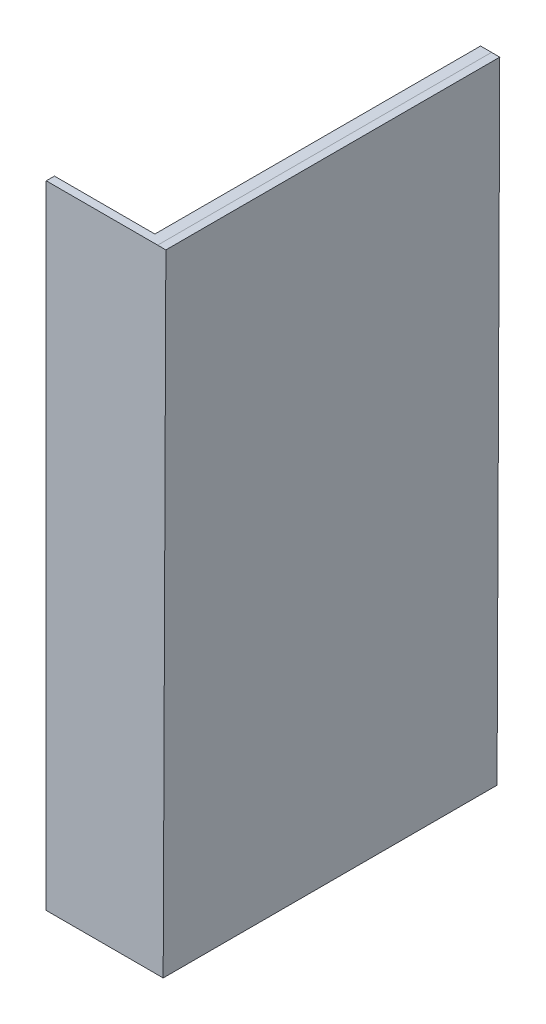
ISO-10303-21;
HEADER;
FILE_DESCRIPTION(('STEP AP214'),'2;1');
FILE_NAME('part.step','',(''),(''),'','','');
FILE_SCHEMA(('AUTOMOTIVE_DESIGN { 1 0 10303 214 1 1 1 1 }'));
ENDSEC;
DATA;
#1=APPLICATION_CONTEXT('core data for automotive mechanical design processes');
#2=APPLICATION_PROTOCOL_DEFINITION('international standard','automotive_design',2000,#1);
#3=PRODUCT_CONTEXT('',#1,'mechanical');
#4=PRODUCT('Part','Part','',(#3));
#5=PRODUCT_RELATED_PRODUCT_CATEGORY('part','',(#4));
#6=PRODUCT_DEFINITION_FORMATION('','',#4);
#7=PRODUCT_DEFINITION_CONTEXT('part definition',#1,'design');
#8=PRODUCT_DEFINITION('design','',#6,#7);
#9=PRODUCT_DEFINITION_SHAPE('','',#8);
#10=(LENGTH_UNIT() NAMED_UNIT(*) SI_UNIT(.MILLI.,.METRE.));
#11=(NAMED_UNIT(*) PLANE_ANGLE_UNIT() SI_UNIT($,.RADIAN.));
#12=(NAMED_UNIT(*) SI_UNIT($,.STERADIAN.) SOLID_ANGLE_UNIT());
#13=UNCERTAINTY_MEASURE_WITH_UNIT(LENGTH_MEASURE(1.E-05),#10,'distance_accuracy_value','');
#14=(GEOMETRIC_REPRESENTATION_CONTEXT(3) GLOBAL_UNCERTAINTY_ASSIGNED_CONTEXT((#13)) GLOBAL_UNIT_ASSIGNED_CONTEXT((#10,
#11,#12)) REPRESENTATION_CONTEXT('',''));
#15=CARTESIAN_POINT('',(0.,0.,0.));
#16=DIRECTION('',(0.,0.,1.));
#17=DIRECTION('',(1.,0.,0.));
#18=AXIS2_PLACEMENT_3D('',#15,#16,#17);
#19=CARTESIAN_POINT('',(-1606.841446163,1223.69751937865,150.));
#20=DIRECTION('',(0.,-1.,0.));
#21=DIRECTION('',(0.,0.,-1.));
#22=AXIS2_PLACEMENT_3D('',#19,#20,#21);
#23=PLANE('',#22);
#24=DIRECTION('',(0.,0.,-1.));
#25=VECTOR('',#24,1.);
#26=CARTESIAN_POINT('',(429.510216102072,1223.69751937865,150.));
#27=LINE('',#26,#25);
#28=CARTESIAN_POINT('',(429.510216102072,1223.69751937865,150.));
#29=VERTEX_POINT('',#28);
#30=CARTESIAN_POINT('',(429.510216102072,1223.69751937865,-5952.99999999999));
#31=VERTEX_POINT('',#30);
#32=EDGE_CURVE('E11',#29,#31,#27,.T.);
#33=ORIENTED_EDGE('',*,*,#32,.T.);
#34=DIRECTION('',(1.,0.,0.));
#35=VECTOR('',#34,1.);
#36=CARTESIAN_POINT('',(228.364442926147,1223.69751937865,-5952.99999999999));
#37=LINE('',#36,#35);
#38=CARTESIAN_POINT('',(228.364442926147,1223.69751937865,-5952.99999999999));
#39=VERTEX_POINT('',#38);
#40=EDGE_CURVE('E109',#39,#31,#37,.T.);
#41=ORIENTED_EDGE('',*,*,#40,.F.);
#42=DIRECTION('',(0.,0.,1.));
#43=VECTOR('',#42,1.);
#44=CARTESIAN_POINT('',(228.364442926147,1223.69751937865,-5952.99999999999));
#45=LINE('',#44,#43);
#46=CARTESIAN_POINT('',(228.364442926147,1223.69751937865,0.));
#47=VERTEX_POINT('',#46);
#48=EDGE_CURVE('E112',#39,#47,#45,.T.);
#49=ORIENTED_EDGE('',*,*,#48,.T.);
#50=DIRECTION('',(-1.,0.,0.));
#51=VECTOR('',#50,1.);
#52=CARTESIAN_POINT('',(-1606.841446163,1223.69751937865,0.));
#53=LINE('',#52,#51);
#54=CARTESIAN_POINT('',(-1606.841446163,1223.69751937865,0.));
#55=VERTEX_POINT('',#54);
#56=EDGE_CURVE('E146',#47,#55,#53,.T.);
#57=ORIENTED_EDGE('',*,*,#56,.T.);
#58=DIRECTION('',(0.,0.,-1.));
#59=VECTOR('',#58,1.);
#60=CARTESIAN_POINT('',(-1606.841446163,1223.69751937865,150.));
#61=LINE('',#60,#59);
#62=CARTESIAN_POINT('',(-1606.841446163,1223.69751937865,150.));
#63=VERTEX_POINT('',#62);
#64=EDGE_CURVE('E42',#63,#55,#61,.T.);
#65=ORIENTED_EDGE('',*,*,#64,.F.);
#66=DIRECTION('',(-1.,0.,0.));
#67=VECTOR('',#66,1.);
#68=CARTESIAN_POINT('',(-1606.841446163,1223.69751937865,150.));
#69=LINE('',#68,#67);
#70=EDGE_CURVE('E81',#29,#63,#69,.T.);
#71=ORIENTED_EDGE('',*,*,#70,.F.);
#72=EDGE_LOOP('',(#33,#41,#49,#57,#65,#71));
#73=FACE_BOUND('',#72,.T.);
#74=ADVANCED_FACE('F35',(#73),#23,.F.);
#75=CARTESIAN_POINT('',(-1606.841446163,1223.69751937865,150.));
#76=DIRECTION('',(1.,0.,0.));
#77=DIRECTION('',(0.,0.,-1.));
#78=AXIS2_PLACEMENT_3D('',#75,#76,#77);
#79=PLANE('',#78);
#80=DIRECTION('',(0.,-1.,0.));
#81=VECTOR('',#80,1.);
#82=CARTESIAN_POINT('',(-1606.841446163,1223.69751937865,0.));
#83=LINE('',#82,#81);
#84=CARTESIAN_POINT('',(-1606.841446163,-10326.4646641854,0.));
#85=VERTEX_POINT('',#84);
#86=EDGE_CURVE('E74',#55,#85,#83,.T.);
#87=ORIENTED_EDGE('',*,*,#86,.T.);
#88=DIRECTION('',(0.,0.,-1.));
#89=VECTOR('',#88,1.);
#90=CARTESIAN_POINT('',(-1606.841446163,-10326.4646641854,150.));
#91=LINE('',#90,#89);
#92=CARTESIAN_POINT('',(-1606.841446163,-10326.4646641854,150.));
#93=VERTEX_POINT('',#92);
#94=EDGE_CURVE('E157',#93,#85,#91,.T.);
#95=ORIENTED_EDGE('',*,*,#94,.F.);
#96=DIRECTION('',(0.,-1.,0.));
#97=VECTOR('',#96,1.);
#98=CARTESIAN_POINT('',(-1606.841446163,1223.69751937865,150.));
#99=LINE('',#98,#97);
#100=EDGE_CURVE('E148',#63,#93,#99,.T.);
#101=ORIENTED_EDGE('',*,*,#100,.F.);
#102=ORIENTED_EDGE('',*,*,#64,.T.);
#103=EDGE_LOOP('',(#87,#95,#101,#102));
#104=FACE_BOUND('',#103,.T.);
#105=ADVANCED_FACE('F159',(#104),#79,.F.);
#106=CARTESIAN_POINT('',(380.263400000016,-10326.4646641854,150.));
#107=DIRECTION('',(0.,1.,0.));
#108=DIRECTION('',(0.,0.,1.));
#109=AXIS2_PLACEMENT_3D('',#106,#107,#108);
#110=PLANE('',#109);
#111=DIRECTION('',(1.,0.,0.));
#112=VECTOR('',#111,1.);
#113=CARTESIAN_POINT('',(380.263400000016,-10326.4646641854,0.));
#114=LINE('',#113,#112);
#115=CARTESIAN_POINT('',(228.364442926147,-10326.4646641854,0.));
#116=VERTEX_POINT('',#115);
#117=EDGE_CURVE('E149',#85,#116,#114,.T.);
#118=ORIENTED_EDGE('',*,*,#117,.T.);
#119=DIRECTION('',(0.,0.,1.));
#120=VECTOR('',#119,1.);
#121=CARTESIAN_POINT('',(228.364442926147,-10326.4646641854,-5952.99999999999));
#122=LINE('',#121,#120);
#123=CARTESIAN_POINT('',(228.364442926147,-10326.4646641854,-5952.99999999999));
#124=VERTEX_POINT('',#123);
#125=EDGE_CURVE('E130',#124,#116,#122,.T.);
#126=ORIENTED_EDGE('',*,*,#125,.F.);
#127=DIRECTION('',(-1.,0.,0.));
#128=VECTOR('',#127,1.);
#129=CARTESIAN_POINT('',(380.263400000016,-10326.4646641854,-5952.99999999999));
#130=LINE('',#129,#128);
#131=CARTESIAN_POINT('',(380.263400000016,-10326.4646641854,-5952.99999999999));
#132=VERTEX_POINT('',#131);
#133=EDGE_CURVE('E123',#132,#124,#130,.T.);
#134=ORIENTED_EDGE('',*,*,#133,.F.);
#135=DIRECTION('',(0.,0.,-1.));
#136=VECTOR('',#135,1.);
#137=CARTESIAN_POINT('',(380.263400000016,-10326.4646641854,150.));
#138=LINE('',#137,#136);
#139=CARTESIAN_POINT('',(380.263400000016,-10326.4646641854,150.));
#140=VERTEX_POINT('',#139);
#141=EDGE_CURVE('E152',#140,#132,#138,.T.);
#142=ORIENTED_EDGE('',*,*,#141,.F.);
#143=DIRECTION('',(1.,0.,0.));
#144=VECTOR('',#143,1.);
#145=CARTESIAN_POINT('',(380.263400000016,-10326.4646641854,150.));
#146=LINE('',#145,#144);
#147=EDGE_CURVE('E58',#93,#140,#146,.T.);
#148=ORIENTED_EDGE('',*,*,#147,.F.);
#149=ORIENTED_EDGE('',*,*,#94,.T.);
#150=EDGE_LOOP('',(#118,#126,#134,#142,#148,#149));
#151=FACE_BOUND('',#150,.T.);
#152=ADVANCED_FACE('F162',(#151),#110,.F.);
#153=CARTESIAN_POINT('',(0.,0.,150.));
#154=DIRECTION('',(0.,0.,-1.));
#155=DIRECTION('',(-1.,0.,0.));
#156=AXIS2_PLACEMENT_3D('',#153,#154,#155);
#157=PLANE('',#156);
#158=ORIENTED_EDGE('',*,*,#147,.T.);
#159=DIRECTION('',(-0.999990910411267,0.00426369497554152,0.));
#160=VECTOR('',#159,1.);
#161=CARTESIAN_POINT('',(530.262036561706,-10327.1042184317,150.));
#162=LINE('',#161,#160);
#163=CARTESIAN_POINT('',(530.262036561706,-10327.1042184317,150.));
#164=VERTEX_POINT('',#163);
#165=EDGE_CURVE('E140',#164,#140,#162,.T.);
#166=ORIENTED_EDGE('',*,*,#165,.F.);
#167=DIRECTION('',(-0.00426369497554151,-0.999990910411267,0.));
#168=VECTOR('',#167,1.);
#169=CARTESIAN_POINT('',(579.508852663762,1223.05796513232,150.));
#170=LINE('',#169,#168);
#171=CARTESIAN_POINT('',(579.508852663762,1223.05796513232,150.));
#172=VERTEX_POINT('',#171);
#173=EDGE_CURVE('E138',#172,#164,#170,.T.);
#174=ORIENTED_EDGE('',*,*,#173,.F.);
#175=DIRECTION('',(-0.999990910411267,0.00426369497554152,0.));
#176=VECTOR('',#175,1.);
#177=CARTESIAN_POINT('',(579.508852663762,1223.05796513232,150.));
#178=LINE('',#177,#176);
#179=EDGE_CURVE('E143',#172,#29,#178,.T.);
#180=ORIENTED_EDGE('',*,*,#179,.T.);
#181=ORIENTED_EDGE('',*,*,#70,.T.);
#182=ORIENTED_EDGE('',*,*,#100,.T.);
#183=EDGE_LOOP('',(#158,#166,#174,#180,#181,#182));
#184=FACE_BOUND('',#183,.T.);
#185=ADVANCED_FACE('F168',(#184),#157,.F.);
#186=CARTESIAN_POINT('',(0.,0.,0.));
#187=DIRECTION('',(0.,0.,-1.));
#188=DIRECTION('',(-1.,0.,0.));
#189=AXIS2_PLACEMENT_3D('',#186,#187,#188);
#190=PLANE('',#189);
#191=DIRECTION('',(0.,1.,0.));
#192=VECTOR('',#191,1.);
#193=CARTESIAN_POINT('',(228.364442926147,-10326.4646641854,0.));
#194=LINE('',#193,#192);
#195=EDGE_CURVE('E49',#116,#47,#194,.T.);
#196=ORIENTED_EDGE('',*,*,#195,.F.);
#197=ORIENTED_EDGE('',*,*,#117,.F.);
#198=ORIENTED_EDGE('',*,*,#86,.F.);
#199=ORIENTED_EDGE('',*,*,#56,.F.);
#200=EDGE_LOOP('',(#196,#197,#198,#199));
#201=FACE_BOUND('',#200,.T.);
#202=ADVANCED_FACE('F160',(#201),#190,.T.);
#203=CARTESIAN_POINT('',(530.262036561706,-10327.1042184317,150.));
#204=DIRECTION('',(0.00426369497554152,0.999990910411267,0.));
#205=DIRECTION('',(-0.999990910411268,0.00426369497554152,0.));
#206=AXIS2_PLACEMENT_3D('',#203,#204,#205);
#207=PLANE('',#206);
#208=ORIENTED_EDGE('',*,*,#141,.T.);
#209=DIRECTION('',(-0.999990910411268,0.00426369497554665,0.));
#210=VECTOR('',#209,1.);
#211=CARTESIAN_POINT('',(530.262036561706,-10327.1042184317,-5952.99999999999));
#212=LINE('',#211,#210);
#213=CARTESIAN_POINT('',(530.262036561706,-10327.1042184317,-5952.99999999999));
#214=VERTEX_POINT('',#213);
#215=EDGE_CURVE('E178',#214,#132,#212,.T.);
#216=ORIENTED_EDGE('',*,*,#215,.F.);
#217=DIRECTION('',(0.,0.,-1.));
#218=VECTOR('',#217,1.);
#219=CARTESIAN_POINT('',(530.262036561706,-10327.1042184317,150.));
#220=LINE('',#219,#218);
#221=EDGE_CURVE('E129',#164,#214,#220,.T.);
#222=ORIENTED_EDGE('',*,*,#221,.F.);
#223=ORIENTED_EDGE('',*,*,#165,.T.);
#224=EDGE_LOOP('',(#208,#216,#222,#223));
#225=FACE_BOUND('',#224,.T.);
#226=ADVANCED_FACE('F166',(#225),#207,.F.);
#227=CARTESIAN_POINT('',(579.508852663762,1223.05796513232,0.));
#228=DIRECTION('',(-0.00426369497554152,-0.999990910411267,0.));
#229=DIRECTION('',(0.999990910411268,-0.00426369497554152,0.));
#230=AXIS2_PLACEMENT_3D('',#227,#228,#229);
#231=PLANE('',#230);
#232=ORIENTED_EDGE('',*,*,#32,.F.);
#233=ORIENTED_EDGE('',*,*,#179,.F.);
#234=DIRECTION('',(0.,0.,1.));
#235=VECTOR('',#234,1.);
#236=CARTESIAN_POINT('',(579.508852663762,1223.05796513232,0.));
#237=LINE('',#236,#235);
#238=CARTESIAN_POINT('',(579.508852663762,1223.05796513232,-5952.99999999999));
#239=VERTEX_POINT('',#238);
#240=EDGE_CURVE('E132',#239,#172,#237,.T.);
#241=ORIENTED_EDGE('',*,*,#240,.F.);
#242=DIRECTION('',(0.999990910411267,-0.0042636949755422,0.));
#243=VECTOR('',#242,1.);
#244=CARTESIAN_POINT('',(429.510216102072,1223.69751937865,-5952.99999999999));
#245=LINE('',#244,#243);
#246=EDGE_CURVE('E116',#31,#239,#245,.T.);
#247=ORIENTED_EDGE('',*,*,#246,.F.);
#248=EDGE_LOOP('',(#232,#233,#241,#247));
#249=FACE_BOUND('',#248,.T.);
#250=ADVANCED_FACE('F176',(#249),#231,.F.);
#251=CARTESIAN_POINT('',(574.283619016533,-2.44859243763482,0.));
#252=DIRECTION('',(0.999990910411268,-0.00426369497554151,0.));
#253=DIRECTION('',(0.00426369497554151,0.999990910411268,0.));
#254=AXIS2_PLACEMENT_3D('',#251,#252,#253);
#255=PLANE('',#254);
#256=ORIENTED_EDGE('',*,*,#221,.T.);
#257=DIRECTION('',(-0.00426369497554151,-0.999990910411267,0.));
#258=VECTOR('',#257,1.);
#259=CARTESIAN_POINT('',(579.508852663762,1223.05796513232,-5952.99999999999));
#260=LINE('',#259,#258);
#261=EDGE_CURVE('E174',#239,#214,#260,.T.);
#262=ORIENTED_EDGE('',*,*,#261,.F.);
#263=ORIENTED_EDGE('',*,*,#240,.T.);
#264=ORIENTED_EDGE('',*,*,#173,.T.);
#265=EDGE_LOOP('',(#256,#262,#263,#264));
#266=FACE_BOUND('',#265,.T.);
#267=ADVANCED_FACE('F171',(#266),#255,.T.);
#268=CARTESIAN_POINT('',(228.364442926147,-10326.4646641854,-5952.99999999999));
#269=DIRECTION('',(1.,0.,0.));
#270=DIRECTION('',(0.,1.,0.));
#271=AXIS2_PLACEMENT_3D('',#268,#269,#270);
#272=PLANE('',#271);
#273=ORIENTED_EDGE('',*,*,#195,.T.);
#274=ORIENTED_EDGE('',*,*,#48,.F.);
#275=DIRECTION('',(0.,1.,0.));
#276=VECTOR('',#275,1.);
#277=CARTESIAN_POINT('',(228.364442926147,-10326.4646641854,-5952.99999999999));
#278=LINE('',#277,#276);
#279=EDGE_CURVE('E117',#124,#39,#278,.T.);
#280=ORIENTED_EDGE('',*,*,#279,.F.);
#281=ORIENTED_EDGE('',*,*,#125,.T.);
#282=EDGE_LOOP('',(#273,#274,#280,#281));
#283=FACE_BOUND('',#282,.T.);
#284=ADVANCED_FACE('F128',(#283),#272,.F.);
#285=CARTESIAN_POINT('',(0.,0.,-5952.99999999999));
#286=DIRECTION('',(0.,0.,-1.));
#287=DIRECTION('',(-1.,0.,0.));
#288=AXIS2_PLACEMENT_3D('',#285,#286,#287);
#289=PLANE('',#288);
#290=ORIENTED_EDGE('',*,*,#279,.T.);
#291=ORIENTED_EDGE('',*,*,#40,.T.);
#292=ORIENTED_EDGE('',*,*,#246,.T.);
#293=ORIENTED_EDGE('',*,*,#261,.T.);
#294=ORIENTED_EDGE('',*,*,#215,.T.);
#295=ORIENTED_EDGE('',*,*,#133,.T.);
#296=EDGE_LOOP('',(#290,#291,#292,#293,#294,#295));
#297=FACE_BOUND('',#296,.T.);
#298=ADVANCED_FACE('F120',(#297),#289,.T.);
#299=CLOSED_SHELL('',(#74,#105,#152,#185,#202,#226,#250,#267,#284,#298));
#300=MANIFOLD_SOLID_BREP('B2',#299);
#301=ADVANCED_BREP_SHAPE_REPRESENTATION('',(#18,#300),#14);
#302=SHAPE_DEFINITION_REPRESENTATION(#9,#301);
ENDSEC;
END-ISO-10303-21;
